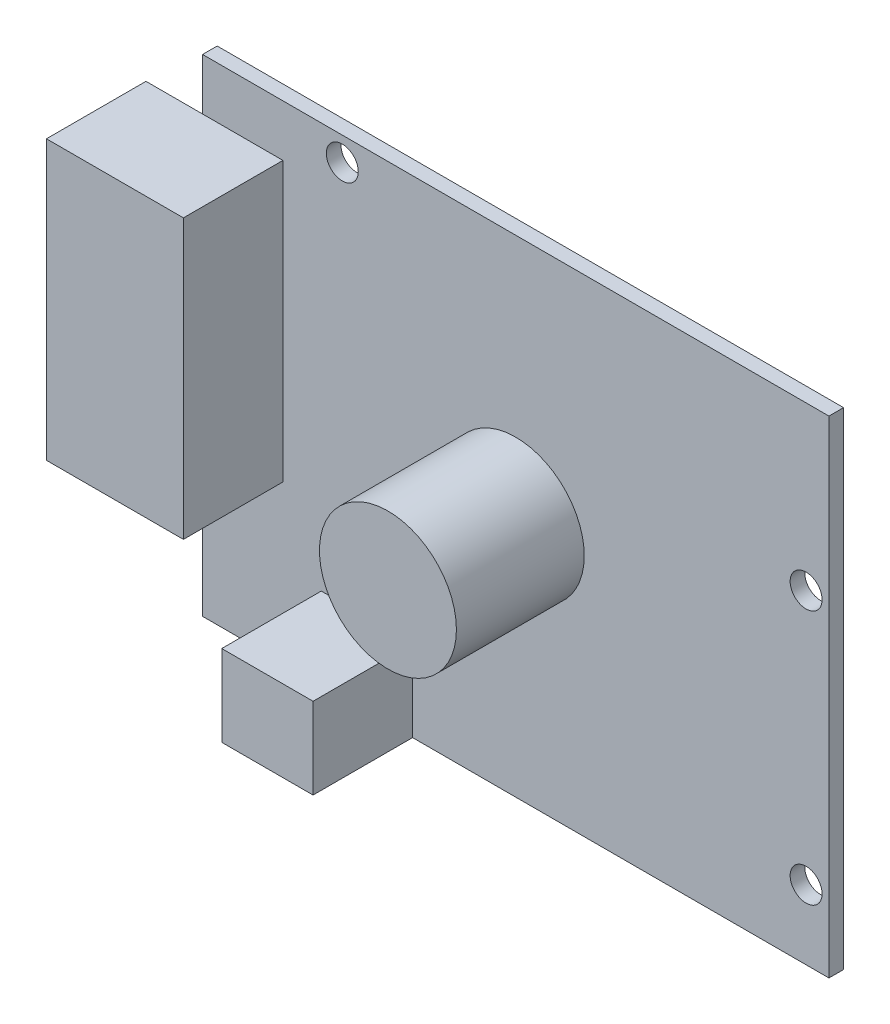
ISO-10303-21;
HEADER;
FILE_DESCRIPTION(('STEP AP214'),'2;1');
FILE_NAME('part.step','',(''),(''),'','','');
FILE_SCHEMA(('AUTOMOTIVE_DESIGN { 1 0 10303 214 1 1 1 1 }'));
ENDSEC;
DATA;
#1=APPLICATION_CONTEXT('core data for automotive mechanical design processes');
#2=APPLICATION_PROTOCOL_DEFINITION('international standard','automotive_design',2000,#1);
#3=PRODUCT_CONTEXT('',#1,'mechanical');
#4=PRODUCT('Part','Part','',(#3));
#5=PRODUCT_RELATED_PRODUCT_CATEGORY('part','',(#4));
#6=PRODUCT_DEFINITION_FORMATION('','',#4);
#7=PRODUCT_DEFINITION_CONTEXT('part definition',#1,'design');
#8=PRODUCT_DEFINITION('design','',#6,#7);
#9=PRODUCT_DEFINITION_SHAPE('','',#8);
#10=(LENGTH_UNIT() NAMED_UNIT(*) SI_UNIT(.MILLI.,.METRE.));
#11=(NAMED_UNIT(*) PLANE_ANGLE_UNIT() SI_UNIT($,.RADIAN.));
#12=(NAMED_UNIT(*) SI_UNIT($,.STERADIAN.) SOLID_ANGLE_UNIT());
#13=UNCERTAINTY_MEASURE_WITH_UNIT(LENGTH_MEASURE(1.E-05),#10,'distance_accuracy_value','');
#14=(GEOMETRIC_REPRESENTATION_CONTEXT(3) GLOBAL_UNCERTAINTY_ASSIGNED_CONTEXT((#13)) GLOBAL_UNIT_ASSIGNED_CONTEXT((#10,
#11,#12)) REPRESENTATION_CONTEXT('',''));
#15=CARTESIAN_POINT('',(0.,0.,0.));
#16=DIRECTION('',(0.,0.,1.));
#17=DIRECTION('',(1.,0.,0.));
#18=AXIS2_PLACEMENT_3D('',#15,#16,#17);
#19=CARTESIAN_POINT('',(0.,0.,1.6));
#20=DIRECTION('',(0.,0.,1.));
#21=DIRECTION('',(1.,0.,0.));
#22=AXIS2_PLACEMENT_3D('',#19,#20,#21);
#23=PLANE('',#22);
#24=CARTESIAN_POINT('',(-19.,24.05,1.6));
#25=DIRECTION('',(0.,0.,1.));
#26=DIRECTION('',(1.,0.,0.));
#27=AXIS2_PLACEMENT_3D('',#24,#25,#26);
#28=CIRCLE('',#27,1.75);
#29=CARTESIAN_POINT('',(-17.25,24.05,1.6));
#30=VERTEX_POINT('',#29);
#31=EDGE_CURVE('E167',#30,#30,#28,.T.);
#32=ORIENTED_EDGE('',*,*,#31,.F.);
#33=EDGE_LOOP('',(#32));
#34=FACE_BOUND('',#33,.T.);
#35=CARTESIAN_POINT('',(-20.3,-24.15,1.6));
#36=DIRECTION('',(0.,0.,1.));
#37=DIRECTION('',(1.,0.,0.));
#38=AXIS2_PLACEMENT_3D('',#35,#36,#37);
#39=CIRCLE('',#38,1.75);
#40=CARTESIAN_POINT('',(-21.3,-22.7138593383655,1.6));
#41=VERTEX_POINT('',#40);
#42=CARTESIAN_POINT('',(-21.3,-25.5861406616345,1.6));
#43=VERTEX_POINT('',#42);
#44=EDGE_CURVE('E48',#41,#43,#39,.T.);
#45=ORIENTED_EDGE('',*,*,#44,.F.);
#46=DIRECTION('',(0.,-1.,0.));
#47=VECTOR('',#46,1.);
#48=CARTESIAN_POINT('',(-21.3,-17.75,1.6));
#49=LINE('',#48,#47);
#50=CARTESIAN_POINT('',(-21.3,-17.75,1.6));
#51=VERTEX_POINT('',#50);
#52=EDGE_CURVE('E142',#51,#41,#49,.T.);
#53=ORIENTED_EDGE('',*,*,#52,.F.);
#54=DIRECTION('',(-1.,0.,0.));
#55=VECTOR('',#54,1.);
#56=CARTESIAN_POINT('',(-21.3,-17.75,1.6));
#57=LINE('',#56,#55);
#58=CARTESIAN_POINT('',(-11.3,-17.75,1.6));
#59=VERTEX_POINT('',#58);
#60=EDGE_CURVE('E160',#59,#51,#57,.T.);
#61=ORIENTED_EDGE('',*,*,#60,.F.);
#62=DIRECTION('',(0.,1.,0.));
#63=VECTOR('',#62,1.);
#64=CARTESIAN_POINT('',(-11.3,-17.75,1.6));
#65=LINE('',#64,#63);
#66=CARTESIAN_POINT('',(-11.3,-26.65,1.6));
#67=VERTEX_POINT('',#66);
#68=EDGE_CURVE('E159',#67,#59,#65,.T.);
#69=ORIENTED_EDGE('',*,*,#68,.F.);
#70=DIRECTION('',(1.,0.,0.));
#71=VECTOR('',#70,1.);
#72=CARTESIAN_POINT('',(-34.3,-26.65,1.6));
#73=LINE('',#72,#71);
#74=CARTESIAN_POINT('',(34.3,-26.65,1.6));
#75=VERTEX_POINT('',#74);
#76=EDGE_CURVE('E227',#67,#75,#73,.T.);
#77=ORIENTED_EDGE('',*,*,#76,.T.);
#78=DIRECTION('',(0.,1.,0.));
#79=VECTOR('',#78,1.);
#80=CARTESIAN_POINT('',(34.3,26.65,1.6));
#81=LINE('',#80,#79);
#82=CARTESIAN_POINT('',(34.3,26.65,1.6));
#83=VERTEX_POINT('',#82);
#84=EDGE_CURVE('E232',#75,#83,#81,.T.);
#85=ORIENTED_EDGE('',*,*,#84,.T.);
#86=DIRECTION('',(-1.,0.,0.));
#87=VECTOR('',#86,1.);
#88=CARTESIAN_POINT('',(-34.3,26.65,1.6));
#89=LINE('',#88,#87);
#90=CARTESIAN_POINT('',(-34.3,26.65,1.6));
#91=VERTEX_POINT('',#90);
#92=EDGE_CURVE('E234',#83,#91,#89,.T.);
#93=ORIENTED_EDGE('',*,*,#92,.T.);
#94=DIRECTION('',(0.,-1.,0.));
#95=VECTOR('',#94,1.);
#96=CARTESIAN_POINT('',(-34.3,26.65,1.6));
#97=LINE('',#96,#95);
#98=CARTESIAN_POINT('',(-34.3,21.,1.6));
#99=VERTEX_POINT('',#98);
#100=EDGE_CURVE('E224',#91,#99,#97,.T.);
#101=ORIENTED_EDGE('',*,*,#100,.T.);
#102=DIRECTION('',(-1.,0.,0.));
#103=VECTOR('',#102,1.);
#104=CARTESIAN_POINT('',(-40.5,21.,1.6));
#105=LINE('',#104,#103);
#106=CARTESIAN_POINT('',(-25.5,21.,1.6));
#107=VERTEX_POINT('',#106);
#108=EDGE_CURVE('E196',#107,#99,#105,.T.);
#109=ORIENTED_EDGE('',*,*,#108,.F.);
#110=DIRECTION('',(0.,1.,0.));
#111=VECTOR('',#110,1.);
#112=CARTESIAN_POINT('',(-25.5,21.,1.6));
#113=LINE('',#112,#111);
#114=CARTESIAN_POINT('',(-25.5,-9.5,1.6));
#115=VERTEX_POINT('',#114);
#116=EDGE_CURVE('E206',#115,#107,#113,.T.);
#117=ORIENTED_EDGE('',*,*,#116,.F.);
#118=DIRECTION('',(1.,0.,0.));
#119=VECTOR('',#118,1.);
#120=CARTESIAN_POINT('',(-40.5,-9.5,1.6));
#121=LINE('',#120,#119);
#122=CARTESIAN_POINT('',(-34.3,-9.49999999999999,1.6));
#123=VERTEX_POINT('',#122);
#124=EDGE_CURVE('E11',#123,#115,#121,.T.);
#125=ORIENTED_EDGE('',*,*,#124,.F.);
#126=CARTESIAN_POINT('',(-34.3,-26.65,1.6));
#127=VERTEX_POINT('',#126);
#128=EDGE_CURVE('E229',#123,#127,#97,.T.);
#129=ORIENTED_EDGE('',*,*,#128,.T.);
#130=CARTESIAN_POINT('',(-21.3,-26.65,1.6));
#131=VERTEX_POINT('',#130);
#132=EDGE_CURVE('E230',#127,#131,#73,.T.);
#133=ORIENTED_EDGE('',*,*,#132,.T.);
#134=EDGE_CURVE('E143',#43,#131,#49,.T.);
#135=ORIENTED_EDGE('',*,*,#134,.F.);
#136=EDGE_LOOP('',(#45,#53,#61,#69,#77,#85,#93,#101,#109,#117,#125,#129,#133,#135));
#137=FACE_BOUND('',#136,.T.);
#138=CARTESIAN_POINT('',(31.8,-19.05,1.6));
#139=DIRECTION('',(0.,0.,1.));
#140=DIRECTION('',(1.,0.,0.));
#141=AXIS2_PLACEMENT_3D('',#138,#139,#140);
#142=CIRCLE('',#141,1.75);
#143=CARTESIAN_POINT('',(33.55,-19.05,1.6));
#144=VERTEX_POINT('',#143);
#145=EDGE_CURVE('E488',#144,#144,#142,.T.);
#146=ORIENTED_EDGE('',*,*,#145,.F.);
#147=EDGE_LOOP('',(#146));
#148=FACE_BOUND('',#147,.T.);
#149=CARTESIAN_POINT('',(31.8,8.84999999999999,1.6));
#150=DIRECTION('',(0.,0.,1.));
#151=DIRECTION('',(1.,0.,0.));
#152=AXIS2_PLACEMENT_3D('',#149,#150,#151);
#153=CIRCLE('',#152,1.75);
#154=CARTESIAN_POINT('',(33.55,8.84999999999999,1.6));
#155=VERTEX_POINT('',#154);
#156=EDGE_CURVE('E478',#155,#155,#153,.T.);
#157=ORIENTED_EDGE('',*,*,#156,.F.);
#158=EDGE_LOOP('',(#157));
#159=FACE_BOUND('',#158,.T.);
#160=CARTESIAN_POINT('',(0.,0.,1.6));
#161=DIRECTION('',(0.,0.,1.));
#162=DIRECTION('',(1.,0.,0.));
#163=AXIS2_PLACEMENT_3D('',#160,#161,#162);
#164=CIRCLE('',#163,7.5);
#165=CARTESIAN_POINT('',(7.5,0.,1.6));
#166=VERTEX_POINT('',#165);
#167=EDGE_CURVE('E479',#166,#166,#164,.T.);
#168=ORIENTED_EDGE('',*,*,#167,.F.);
#169=EDGE_LOOP('',(#168));
#170=FACE_BOUND('',#169,.T.);
#171=ADVANCED_FACE('F32',(#34,#137,#148,#159,#170),#23,.T.);
#172=CARTESIAN_POINT('',(-34.3,26.65,1.6));
#173=DIRECTION('',(1.,0.,0.));
#174=DIRECTION('',(0.,0.,-1.));
#175=AXIS2_PLACEMENT_3D('',#172,#173,#174);
#176=PLANE('',#175);
#177=DIRECTION('',(0.,-1.,0.));
#178=VECTOR('',#177,1.);
#179=CARTESIAN_POINT('',(-34.3,26.65,0.));
#180=LINE('',#179,#178);
#181=CARTESIAN_POINT('',(-34.3,26.65,0.));
#182=VERTEX_POINT('',#181);
#183=CARTESIAN_POINT('',(-34.3,-26.65,0.));
#184=VERTEX_POINT('',#183);
#185=EDGE_CURVE('E223',#182,#184,#180,.T.);
#186=ORIENTED_EDGE('',*,*,#185,.T.);
#187=DIRECTION('',(0.,0.,-1.));
#188=VECTOR('',#187,1.);
#189=CARTESIAN_POINT('',(-34.3,-26.65,1.6));
#190=LINE('',#189,#188);
#191=EDGE_CURVE('E36',#127,#184,#190,.T.);
#192=ORIENTED_EDGE('',*,*,#191,.F.);
#193=ORIENTED_EDGE('',*,*,#128,.F.);
#194=EDGE_CURVE('E228',#99,#123,#97,.T.);
#195=ORIENTED_EDGE('',*,*,#194,.F.);
#196=ORIENTED_EDGE('',*,*,#100,.F.);
#197=DIRECTION('',(0.,0.,-1.));
#198=VECTOR('',#197,1.);
#199=CARTESIAN_POINT('',(-34.3,26.65,1.6));
#200=LINE('',#199,#198);
#201=EDGE_CURVE('E236',#91,#182,#200,.T.);
#202=ORIENTED_EDGE('',*,*,#201,.T.);
#203=EDGE_LOOP('',(#186,#192,#193,#195,#196,#202));
#204=FACE_BOUND('',#203,.T.);
#205=ADVANCED_FACE('F34',(#204),#176,.F.);
#206=CARTESIAN_POINT('',(-34.3,-26.65,1.6));
#207=DIRECTION('',(0.,1.,0.));
#208=DIRECTION('',(-1.,0.,0.));
#209=AXIS2_PLACEMENT_3D('',#206,#207,#208);
#210=PLANE('',#209);
#211=DIRECTION('',(1.,0.,0.));
#212=VECTOR('',#211,1.);
#213=CARTESIAN_POINT('',(-34.3,-26.65,0.));
#214=LINE('',#213,#212);
#215=CARTESIAN_POINT('',(34.3,-26.65,0.));
#216=VERTEX_POINT('',#215);
#217=EDGE_CURVE('E239',#184,#216,#214,.T.);
#218=ORIENTED_EDGE('',*,*,#217,.T.);
#219=DIRECTION('',(0.,0.,-1.));
#220=VECTOR('',#219,1.);
#221=CARTESIAN_POINT('',(34.3,-26.65,1.6));
#222=LINE('',#221,#220);
#223=EDGE_CURVE('E249',#75,#216,#222,.T.);
#224=ORIENTED_EDGE('',*,*,#223,.F.);
#225=ORIENTED_EDGE('',*,*,#76,.F.);
#226=DIRECTION('',(0.,0.,-1.));
#227=VECTOR('',#226,1.);
#228=CARTESIAN_POINT('',(-11.3,-26.65,12.5));
#229=LINE('',#228,#227);
#230=CARTESIAN_POINT('',(-11.3,-26.65,12.5));
#231=VERTEX_POINT('',#230);
#232=EDGE_CURVE('E184',#231,#67,#229,.T.);
#233=ORIENTED_EDGE('',*,*,#232,.F.);
#234=DIRECTION('',(1.,0.,0.));
#235=VECTOR('',#234,1.);
#236=CARTESIAN_POINT('',(-21.3,-26.65,12.5));
#237=LINE('',#236,#235);
#238=CARTESIAN_POINT('',(-21.3,-26.65,12.5));
#239=VERTEX_POINT('',#238);
#240=EDGE_CURVE('E178',#239,#231,#237,.T.);
#241=ORIENTED_EDGE('',*,*,#240,.F.);
#242=DIRECTION('',(0.,0.,-1.));
#243=VECTOR('',#242,1.);
#244=CARTESIAN_POINT('',(-21.3,-26.65,12.5));
#245=LINE('',#244,#243);
#246=EDGE_CURVE('E189',#239,#131,#245,.T.);
#247=ORIENTED_EDGE('',*,*,#246,.T.);
#248=ORIENTED_EDGE('',*,*,#132,.F.);
#249=ORIENTED_EDGE('',*,*,#191,.T.);
#250=EDGE_LOOP('',(#218,#224,#225,#233,#241,#247,#248,#249));
#251=FACE_BOUND('',#250,.T.);
#252=ADVANCED_FACE('F259',(#251),#210,.F.);
#253=CARTESIAN_POINT('',(34.3,26.65,1.6));
#254=DIRECTION('',(-1.,0.,0.));
#255=DIRECTION('',(0.,0.,1.));
#256=AXIS2_PLACEMENT_3D('',#253,#254,#255);
#257=PLANE('',#256);
#258=DIRECTION('',(0.,1.,0.));
#259=VECTOR('',#258,1.);
#260=CARTESIAN_POINT('',(34.3,26.65,0.));
#261=LINE('',#260,#259);
#262=CARTESIAN_POINT('',(34.3,26.65,0.));
#263=VERTEX_POINT('',#262);
#264=EDGE_CURVE('E241',#216,#263,#261,.T.);
#265=ORIENTED_EDGE('',*,*,#264,.T.);
#266=DIRECTION('',(0.,0.,-1.));
#267=VECTOR('',#266,1.);
#268=CARTESIAN_POINT('',(34.3,26.65,1.6));
#269=LINE('',#268,#267);
#270=EDGE_CURVE('E247',#83,#263,#269,.T.);
#271=ORIENTED_EDGE('',*,*,#270,.F.);
#272=ORIENTED_EDGE('',*,*,#84,.F.);
#273=ORIENTED_EDGE('',*,*,#223,.T.);
#274=EDGE_LOOP('',(#265,#271,#272,#273));
#275=FACE_BOUND('',#274,.T.);
#276=ADVANCED_FACE('F269',(#275),#257,.F.);
#277=CARTESIAN_POINT('',(-34.3,26.65,1.6));
#278=DIRECTION('',(0.,-1.,0.));
#279=DIRECTION('',(0.,0.,-1.));
#280=AXIS2_PLACEMENT_3D('',#277,#278,#279);
#281=PLANE('',#280);
#282=DIRECTION('',(-1.,0.,0.));
#283=VECTOR('',#282,1.);
#284=CARTESIAN_POINT('',(-34.3,26.65,0.));
#285=LINE('',#284,#283);
#286=EDGE_CURVE('E243',#263,#182,#285,.T.);
#287=ORIENTED_EDGE('',*,*,#286,.T.);
#288=ORIENTED_EDGE('',*,*,#201,.F.);
#289=ORIENTED_EDGE('',*,*,#92,.F.);
#290=ORIENTED_EDGE('',*,*,#270,.T.);
#291=EDGE_LOOP('',(#287,#288,#289,#290));
#292=FACE_BOUND('',#291,.T.);
#293=ADVANCED_FACE('F272',(#292),#281,.F.);
#294=CARTESIAN_POINT('',(0.,0.,0.));
#295=DIRECTION('',(0.,0.,1.));
#296=DIRECTION('',(1.,0.,0.));
#297=AXIS2_PLACEMENT_3D('',#294,#295,#296);
#298=PLANE('',#297);
#299=CARTESIAN_POINT('',(31.8,8.84999999999999,0.));
#300=DIRECTION('',(0.,0.,1.));
#301=DIRECTION('',(1.,0.,0.));
#302=AXIS2_PLACEMENT_3D('',#299,#300,#301);
#303=CIRCLE('',#302,1.75);
#304=CARTESIAN_POINT('',(33.55,8.84999999999999,0.));
#305=VERTEX_POINT('',#304);
#306=EDGE_CURVE('E482',#305,#305,#303,.T.);
#307=ORIENTED_EDGE('',*,*,#306,.T.);
#308=EDGE_LOOP('',(#307));
#309=FACE_BOUND('',#308,.T.);
#310=CARTESIAN_POINT('',(31.8,-19.05,0.));
#311=DIRECTION('',(0.,0.,1.));
#312=DIRECTION('',(1.,0.,0.));
#313=AXIS2_PLACEMENT_3D('',#310,#311,#312);
#314=CIRCLE('',#313,1.75);
#315=CARTESIAN_POINT('',(33.55,-19.05,0.));
#316=VERTEX_POINT('',#315);
#317=EDGE_CURVE('E146',#316,#316,#314,.T.);
#318=ORIENTED_EDGE('',*,*,#317,.T.);
#319=EDGE_LOOP('',(#318));
#320=FACE_BOUND('',#319,.T.);
#321=CARTESIAN_POINT('',(-20.3,-24.15,0.));
#322=DIRECTION('',(0.,0.,1.));
#323=DIRECTION('',(1.,0.,0.));
#324=AXIS2_PLACEMENT_3D('',#321,#322,#323);
#325=CIRCLE('',#324,1.75);
#326=CARTESIAN_POINT('',(-18.55,-24.15,0.));
#327=VERTEX_POINT('',#326);
#328=EDGE_CURVE('E153',#327,#327,#325,.T.);
#329=ORIENTED_EDGE('',*,*,#328,.T.);
#330=EDGE_LOOP('',(#329));
#331=FACE_BOUND('',#330,.T.);
#332=CARTESIAN_POINT('',(-19.,24.05,0.));
#333=DIRECTION('',(0.,0.,1.));
#334=DIRECTION('',(1.,0.,0.));
#335=AXIS2_PLACEMENT_3D('',#332,#333,#334);
#336=CIRCLE('',#335,1.75);
#337=CARTESIAN_POINT('',(-17.25,24.05,0.));
#338=VERTEX_POINT('',#337);
#339=EDGE_CURVE('E163',#338,#338,#336,.T.);
#340=ORIENTED_EDGE('',*,*,#339,.T.);
#341=EDGE_LOOP('',(#340));
#342=FACE_BOUND('',#341,.T.);
#343=ORIENTED_EDGE('',*,*,#185,.F.);
#344=ORIENTED_EDGE('',*,*,#286,.F.);
#345=ORIENTED_EDGE('',*,*,#264,.F.);
#346=ORIENTED_EDGE('',*,*,#217,.F.);
#347=EDGE_LOOP('',(#343,#344,#345,#346));
#348=FACE_BOUND('',#347,.T.);
#349=ADVANCED_FACE('F267',(#309,#320,#331,#342,#348),#298,.F.);
#350=CARTESIAN_POINT('',(0.,0.,1.6));
#351=DIRECTION('',(0.,0.,1.));
#352=DIRECTION('',(1.,0.,0.));
#353=AXIS2_PLACEMENT_3D('',#350,#351,#352);
#354=PLANE('',#353);
#355=CARTESIAN_POINT('',(-40.5,21.,1.6));
#356=VERTEX_POINT('',#355);
#357=EDGE_CURVE('E209',#99,#356,#105,.T.);
#358=ORIENTED_EDGE('',*,*,#357,.F.);
#359=ORIENTED_EDGE('',*,*,#194,.T.);
#360=CARTESIAN_POINT('',(-40.5,-9.5,1.6));
#361=VERTEX_POINT('',#360);
#362=EDGE_CURVE('E42',#361,#123,#121,.T.);
#363=ORIENTED_EDGE('',*,*,#362,.F.);
#364=DIRECTION('',(0.,-1.,0.));
#365=VECTOR('',#364,1.);
#366=CARTESIAN_POINT('',(-40.5,21.,1.6));
#367=LINE('',#366,#365);
#368=EDGE_CURVE('E191',#356,#361,#367,.T.);
#369=ORIENTED_EDGE('',*,*,#368,.F.);
#370=EDGE_LOOP('',(#358,#359,#363,#369));
#371=FACE_BOUND('',#370,.T.);
#372=ADVANCED_FACE('F283',(#371),#354,.F.);
#373=CARTESIAN_POINT('',(-40.5,21.,12.5));
#374=DIRECTION('',(1.,0.,0.));
#375=DIRECTION('',(0.,1.,0.));
#376=AXIS2_PLACEMENT_3D('',#373,#374,#375);
#377=PLANE('',#376);
#378=ORIENTED_EDGE('',*,*,#368,.T.);
#379=DIRECTION('',(0.,0.,-1.));
#380=VECTOR('',#379,1.);
#381=CARTESIAN_POINT('',(-40.5,-9.5,12.5));
#382=LINE('',#381,#380);
#383=CARTESIAN_POINT('',(-40.5,-9.5,12.5));
#384=VERTEX_POINT('',#383);
#385=EDGE_CURVE('E220',#384,#361,#382,.T.);
#386=ORIENTED_EDGE('',*,*,#385,.F.);
#387=DIRECTION('',(0.,-1.,0.));
#388=VECTOR('',#387,1.);
#389=CARTESIAN_POINT('',(-40.5,21.,12.5));
#390=LINE('',#389,#388);
#391=CARTESIAN_POINT('',(-40.5,21.,12.5));
#392=VERTEX_POINT('',#391);
#393=EDGE_CURVE('E192',#392,#384,#390,.T.);
#394=ORIENTED_EDGE('',*,*,#393,.F.);
#395=DIRECTION('',(0.,0.,-1.));
#396=VECTOR('',#395,1.);
#397=CARTESIAN_POINT('',(-40.5,21.,12.5));
#398=LINE('',#397,#396);
#399=EDGE_CURVE('E202',#392,#356,#398,.T.);
#400=ORIENTED_EDGE('',*,*,#399,.T.);
#401=EDGE_LOOP('',(#378,#386,#394,#400));
#402=FACE_BOUND('',#401,.T.);
#403=ADVANCED_FACE('F291',(#402),#377,.F.);
#404=CARTESIAN_POINT('',(-40.5,-9.5,12.5));
#405=DIRECTION('',(0.,1.,0.));
#406=DIRECTION('',(0.,0.,1.));
#407=AXIS2_PLACEMENT_3D('',#404,#405,#406);
#408=PLANE('',#407);
#409=ORIENTED_EDGE('',*,*,#362,.T.);
#410=ORIENTED_EDGE('',*,*,#124,.T.);
#411=DIRECTION('',(0.,0.,-1.));
#412=VECTOR('',#411,1.);
#413=CARTESIAN_POINT('',(-25.5,-9.5,12.5));
#414=LINE('',#413,#412);
#415=CARTESIAN_POINT('',(-25.5,-9.5,12.5));
#416=VERTEX_POINT('',#415);
#417=EDGE_CURVE('E217',#416,#115,#414,.T.);
#418=ORIENTED_EDGE('',*,*,#417,.F.);
#419=DIRECTION('',(1.,0.,0.));
#420=VECTOR('',#419,1.);
#421=CARTESIAN_POINT('',(-40.5,-9.5,12.5));
#422=LINE('',#421,#420);
#423=EDGE_CURVE('E195',#384,#416,#422,.T.);
#424=ORIENTED_EDGE('',*,*,#423,.F.);
#425=ORIENTED_EDGE('',*,*,#385,.T.);
#426=EDGE_LOOP('',(#409,#410,#418,#424,#425));
#427=FACE_BOUND('',#426,.T.);
#428=ADVANCED_FACE('F286',(#427),#408,.F.);
#429=CARTESIAN_POINT('',(-25.5,21.,12.5));
#430=DIRECTION('',(-1.,0.,0.));
#431=DIRECTION('',(0.,-1.,0.));
#432=AXIS2_PLACEMENT_3D('',#429,#430,#431);
#433=PLANE('',#432);
#434=ORIENTED_EDGE('',*,*,#116,.T.);
#435=DIRECTION('',(0.,0.,-1.));
#436=VECTOR('',#435,1.);
#437=CARTESIAN_POINT('',(-25.5,21.,12.5));
#438=LINE('',#437,#436);
#439=CARTESIAN_POINT('',(-25.5,21.,12.5));
#440=VERTEX_POINT('',#439);
#441=EDGE_CURVE('E214',#440,#107,#438,.T.);
#442=ORIENTED_EDGE('',*,*,#441,.F.);
#443=DIRECTION('',(0.,1.,0.));
#444=VECTOR('',#443,1.);
#445=CARTESIAN_POINT('',(-25.5,21.,12.5));
#446=LINE('',#445,#444);
#447=EDGE_CURVE('E198',#416,#440,#446,.T.);
#448=ORIENTED_EDGE('',*,*,#447,.F.);
#449=ORIENTED_EDGE('',*,*,#417,.T.);
#450=EDGE_LOOP('',(#434,#442,#448,#449));
#451=FACE_BOUND('',#450,.T.);
#452=ADVANCED_FACE('F298',(#451),#433,.F.);
#453=CARTESIAN_POINT('',(-40.5,21.,12.5));
#454=DIRECTION('',(0.,-1.,0.));
#455=DIRECTION('',(0.,0.,-1.));
#456=AXIS2_PLACEMENT_3D('',#453,#454,#455);
#457=PLANE('',#456);
#458=ORIENTED_EDGE('',*,*,#108,.T.);
#459=ORIENTED_EDGE('',*,*,#357,.T.);
#460=ORIENTED_EDGE('',*,*,#399,.F.);
#461=DIRECTION('',(-1.,0.,0.));
#462=VECTOR('',#461,1.);
#463=CARTESIAN_POINT('',(-40.5,21.,12.5));
#464=LINE('',#463,#462);
#465=EDGE_CURVE('E200',#440,#392,#464,.T.);
#466=ORIENTED_EDGE('',*,*,#465,.F.);
#467=ORIENTED_EDGE('',*,*,#441,.T.);
#468=EDGE_LOOP('',(#458,#459,#460,#466,#467));
#469=FACE_BOUND('',#468,.T.);
#470=ADVANCED_FACE('F295',(#469),#457,.F.);
#471=CARTESIAN_POINT('',(0.,0.,12.5));
#472=DIRECTION('',(0.,0.,1.));
#473=DIRECTION('',(1.,0.,0.));
#474=AXIS2_PLACEMENT_3D('',#471,#472,#473);
#475=PLANE('',#474);
#476=ORIENTED_EDGE('',*,*,#393,.T.);
#477=ORIENTED_EDGE('',*,*,#423,.T.);
#478=ORIENTED_EDGE('',*,*,#447,.T.);
#479=ORIENTED_EDGE('',*,*,#465,.T.);
#480=EDGE_LOOP('',(#476,#477,#478,#479));
#481=FACE_BOUND('',#480,.T.);
#482=ADVANCED_FACE('F301',(#481),#475,.T.);
#483=CARTESIAN_POINT('',(-21.3,-17.75,12.5));
#484=DIRECTION('',(1.,0.,0.));
#485=DIRECTION('',(0.,0.,-1.));
#486=AXIS2_PLACEMENT_3D('',#483,#484,#485);
#487=PLANE('',#486);
#488=ORIENTED_EDGE('',*,*,#52,.T.);
#489=EDGE_CURVE('E136',#41,#43,#49,.T.);
#490=ORIENTED_EDGE('',*,*,#489,.T.);
#491=ORIENTED_EDGE('',*,*,#134,.T.);
#492=ORIENTED_EDGE('',*,*,#246,.F.);
#493=DIRECTION('',(0.,-1.,0.));
#494=VECTOR('',#493,1.);
#495=CARTESIAN_POINT('',(-21.3,-17.75,12.5));
#496=LINE('',#495,#494);
#497=CARTESIAN_POINT('',(-21.3,-17.75,12.5));
#498=VERTEX_POINT('',#497);
#499=EDGE_CURVE('E175',#498,#239,#496,.T.);
#500=ORIENTED_EDGE('',*,*,#499,.F.);
#501=DIRECTION('',(0.,0.,-1.));
#502=VECTOR('',#501,1.);
#503=CARTESIAN_POINT('',(-21.3,-17.75,12.5));
#504=LINE('',#503,#502);
#505=EDGE_CURVE('E158',#498,#51,#504,.T.);
#506=ORIENTED_EDGE('',*,*,#505,.T.);
#507=EDGE_LOOP('',(#488,#490,#491,#492,#500,#506));
#508=FACE_BOUND('',#507,.T.);
#509=ADVANCED_FACE('F155',(#508),#487,.F.);
#510=CARTESIAN_POINT('',(-11.3,-17.75,12.5));
#511=DIRECTION('',(-1.,0.,0.));
#512=DIRECTION('',(0.,-1.,0.));
#513=AXIS2_PLACEMENT_3D('',#510,#511,#512);
#514=PLANE('',#513);
#515=ORIENTED_EDGE('',*,*,#68,.T.);
#516=DIRECTION('',(0.,0.,-1.));
#517=VECTOR('',#516,1.);
#518=CARTESIAN_POINT('',(-11.3,-17.75,12.5));
#519=LINE('',#518,#517);
#520=CARTESIAN_POINT('',(-11.3,-17.75,12.5));
#521=VERTEX_POINT('',#520);
#522=EDGE_CURVE('E56',#521,#59,#519,.T.);
#523=ORIENTED_EDGE('',*,*,#522,.F.);
#524=DIRECTION('',(0.,1.,0.));
#525=VECTOR('',#524,1.);
#526=CARTESIAN_POINT('',(-11.3,-17.75,12.5));
#527=LINE('',#526,#525);
#528=EDGE_CURVE('E180',#231,#521,#527,.T.);
#529=ORIENTED_EDGE('',*,*,#528,.F.);
#530=ORIENTED_EDGE('',*,*,#232,.T.);
#531=EDGE_LOOP('',(#515,#523,#529,#530));
#532=FACE_BOUND('',#531,.T.);
#533=ADVANCED_FACE('F279',(#532),#514,.F.);
#534=CARTESIAN_POINT('',(-21.3,-17.75,12.5));
#535=DIRECTION('',(0.,-1.,0.));
#536=DIRECTION('',(1.,0.,0.));
#537=AXIS2_PLACEMENT_3D('',#534,#535,#536);
#538=PLANE('',#537);
#539=ORIENTED_EDGE('',*,*,#60,.T.);
#540=ORIENTED_EDGE('',*,*,#505,.F.);
#541=DIRECTION('',(-1.,0.,0.));
#542=VECTOR('',#541,1.);
#543=CARTESIAN_POINT('',(-21.3,-17.75,12.5));
#544=LINE('',#543,#542);
#545=EDGE_CURVE('E181',#521,#498,#544,.T.);
#546=ORIENTED_EDGE('',*,*,#545,.F.);
#547=ORIENTED_EDGE('',*,*,#522,.T.);
#548=EDGE_LOOP('',(#539,#540,#546,#547));
#549=FACE_BOUND('',#548,.T.);
#550=ADVANCED_FACE('F385',(#549),#538,.F.);
#551=CARTESIAN_POINT('',(0.,0.,12.5));
#552=DIRECTION('',(0.,0.,1.));
#553=DIRECTION('',(1.,0.,0.));
#554=AXIS2_PLACEMENT_3D('',#551,#552,#553);
#555=PLANE('',#554);
#556=ORIENTED_EDGE('',*,*,#499,.T.);
#557=ORIENTED_EDGE('',*,*,#240,.T.);
#558=ORIENTED_EDGE('',*,*,#528,.T.);
#559=ORIENTED_EDGE('',*,*,#545,.T.);
#560=EDGE_LOOP('',(#556,#557,#558,#559));
#561=FACE_BOUND('',#560,.T.);
#562=ADVANCED_FACE('F280',(#561),#555,.T.);
#563=CARTESIAN_POINT('',(-19.,24.05,0.));
#564=DIRECTION('',(0.,0.,1.));
#565=DIRECTION('',(1.,0.,0.));
#566=AXIS2_PLACEMENT_3D('',#563,#564,#565);
#567=CYLINDRICAL_SURFACE('',#566,1.75);
#568=ORIENTED_EDGE('',*,*,#339,.F.);
#569=EDGE_LOOP('',(#568));
#570=FACE_BOUND('',#569,.T.);
#571=ORIENTED_EDGE('',*,*,#31,.T.);
#572=EDGE_LOOP('',(#571));
#573=FACE_BOUND('',#572,.T.);
#574=ADVANCED_FACE('F400',(#570,#573),#567,.F.);
#575=CARTESIAN_POINT('',(-20.3,-24.15,1.6));
#576=DIRECTION('',(0.,0.,1.));
#577=DIRECTION('',(1.,0.,0.));
#578=AXIS2_PLACEMENT_3D('',#575,#576,#577);
#579=PLANE('',#578);
#580=EDGE_CURVE('E138',#43,#41,#39,.T.);
#581=ORIENTED_EDGE('',*,*,#580,.F.);
#582=ORIENTED_EDGE('',*,*,#489,.F.);
#583=EDGE_LOOP('',(#581,#582));
#584=FACE_BOUND('',#583,.T.);
#585=ADVANCED_FACE('F137',(#584),#579,.F.);
#586=CARTESIAN_POINT('',(-20.3,-24.15,0.));
#587=DIRECTION('',(0.,0.,1.));
#588=DIRECTION('',(1.,0.,0.));
#589=AXIS2_PLACEMENT_3D('',#586,#587,#588);
#590=CYLINDRICAL_SURFACE('',#589,1.75);
#591=ORIENTED_EDGE('',*,*,#328,.F.);
#592=EDGE_LOOP('',(#591));
#593=FACE_BOUND('',#592,.T.);
#594=ORIENTED_EDGE('',*,*,#44,.T.);
#595=ORIENTED_EDGE('',*,*,#580,.T.);
#596=EDGE_LOOP('',(#594,#595));
#597=FACE_BOUND('',#596,.T.);
#598=ADVANCED_FACE('F145',(#593,#597),#590,.F.);
#599=CARTESIAN_POINT('',(31.8,-19.05,0.));
#600=DIRECTION('',(0.,0.,1.));
#601=DIRECTION('',(1.,0.,0.));
#602=AXIS2_PLACEMENT_3D('',#599,#600,#601);
#603=CYLINDRICAL_SURFACE('',#602,1.75);
#604=ORIENTED_EDGE('',*,*,#317,.F.);
#605=EDGE_LOOP('',(#604));
#606=FACE_BOUND('',#605,.T.);
#607=ORIENTED_EDGE('',*,*,#145,.T.);
#608=EDGE_LOOP('',(#607));
#609=FACE_BOUND('',#608,.T.);
#610=ADVANCED_FACE('F422',(#606,#609),#603,.F.);
#611=CARTESIAN_POINT('',(31.8,8.84999999999999,0.));
#612=DIRECTION('',(0.,0.,1.));
#613=DIRECTION('',(1.,0.,0.));
#614=AXIS2_PLACEMENT_3D('',#611,#612,#613);
#615=CYLINDRICAL_SURFACE('',#614,1.75);
#616=ORIENTED_EDGE('',*,*,#306,.F.);
#617=EDGE_LOOP('',(#616));
#618=FACE_BOUND('',#617,.T.);
#619=ORIENTED_EDGE('',*,*,#156,.T.);
#620=EDGE_LOOP('',(#619));
#621=FACE_BOUND('',#620,.T.);
#622=ADVANCED_FACE('F430',(#618,#621),#615,.F.);
#623=CARTESIAN_POINT('',(0.,0.,15.6));
#624=DIRECTION('',(0.,0.,-1.));
#625=DIRECTION('',(-1.,0.,0.));
#626=AXIS2_PLACEMENT_3D('',#623,#624,#625);
#627=CYLINDRICAL_SURFACE('',#626,7.5);
#628=CARTESIAN_POINT('',(0.,0.,15.6));
#629=DIRECTION('',(0.,0.,1.));
#630=DIRECTION('',(1.,0.,0.));
#631=AXIS2_PLACEMENT_3D('',#628,#629,#630);
#632=CIRCLE('',#631,7.5);
#633=CARTESIAN_POINT('',(7.5,0.,15.6));
#634=VERTEX_POINT('',#633);
#635=EDGE_CURVE('E477',#634,#634,#632,.T.);
#636=ORIENTED_EDGE('',*,*,#635,.F.);
#637=EDGE_LOOP('',(#636));
#638=FACE_BOUND('',#637,.T.);
#639=ORIENTED_EDGE('',*,*,#167,.T.);
#640=EDGE_LOOP('',(#639));
#641=FACE_BOUND('',#640,.T.);
#642=ADVANCED_FACE('F438',(#638,#641),#627,.T.);
#643=CARTESIAN_POINT('',(0.,0.,15.6));
#644=DIRECTION('',(0.,0.,1.));
#645=DIRECTION('',(1.,0.,0.));
#646=AXIS2_PLACEMENT_3D('',#643,#644,#645);
#647=PLANE('',#646);
#648=ORIENTED_EDGE('',*,*,#635,.T.);
#649=EDGE_LOOP('',(#648));
#650=FACE_BOUND('',#649,.T.);
#651=ADVANCED_FACE('F446',(#650),#647,.T.);
#652=CLOSED_SHELL('',(#171,#205,#252,#276,#293,#349,#372,#403,#428,#452,#470,#482,#509,#533,
#550,#562,#574,#585,#598,#610,#622,#642,#651));
#653=MANIFOLD_SOLID_BREP('B2',#652);
#654=ADVANCED_BREP_SHAPE_REPRESENTATION('',(#18,#653),#14);
#655=SHAPE_DEFINITION_REPRESENTATION(#9,#654);
ENDSEC;
END-ISO-10303-21;
